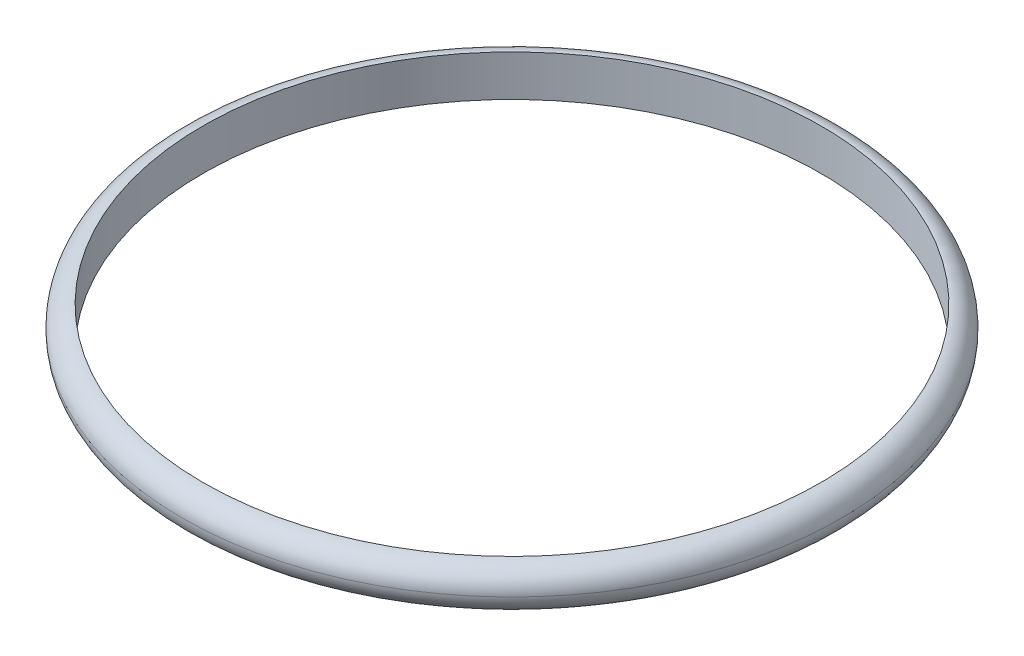
ISO-10303-21;
HEADER;
FILE_DESCRIPTION(('STEP AP214'),'2;1');
FILE_NAME('part.step','',(''),(''),'','','');
FILE_SCHEMA(('AUTOMOTIVE_DESIGN { 1 0 10303 214 1 1 1 1 }'));
ENDSEC;
DATA;
#1=APPLICATION_CONTEXT('core data for automotive mechanical design processes');
#2=APPLICATION_PROTOCOL_DEFINITION('international standard','automotive_design',2000,#1);
#3=PRODUCT_CONTEXT('',#1,'mechanical');
#4=PRODUCT('Part','Part','',(#3));
#5=PRODUCT_RELATED_PRODUCT_CATEGORY('part','',(#4));
#6=PRODUCT_DEFINITION_FORMATION('','',#4);
#7=PRODUCT_DEFINITION_CONTEXT('part definition',#1,'design');
#8=PRODUCT_DEFINITION('design','',#6,#7);
#9=PRODUCT_DEFINITION_SHAPE('','',#8);
#10=(LENGTH_UNIT() NAMED_UNIT(*) SI_UNIT(.MILLI.,.METRE.));
#11=(NAMED_UNIT(*) PLANE_ANGLE_UNIT() SI_UNIT($,.RADIAN.));
#12=(NAMED_UNIT(*) SI_UNIT($,.STERADIAN.) SOLID_ANGLE_UNIT());
#13=UNCERTAINTY_MEASURE_WITH_UNIT(LENGTH_MEASURE(1.E-05),#10,'distance_accuracy_value','');
#14=(GEOMETRIC_REPRESENTATION_CONTEXT(3) GLOBAL_UNCERTAINTY_ASSIGNED_CONTEXT((#13)) GLOBAL_UNIT_ASSIGNED_CONTEXT((#10,
#11,#12)) REPRESENTATION_CONTEXT('',''));
#15=CARTESIAN_POINT('',(0.,0.,0.));
#16=DIRECTION('',(0.,0.,1.));
#17=DIRECTION('',(1.,0.,0.));
#18=AXIS2_PLACEMENT_3D('',#15,#16,#17);
#19=CARTESIAN_POINT('',(0.,4.,0.));
#20=DIRECTION('',(0.,-1.,0.));
#21=DIRECTION('',(0.,0.,-1.));
#22=AXIS2_PLACEMENT_3D('',#19,#20,#21);
#23=CYLINDRICAL_SURFACE('',#22,30.);
#24=CARTESIAN_POINT('',(0.,4.,0.));
#25=DIRECTION('',(0.,1.,0.));
#26=DIRECTION('',(0.,0.,1.));
#27=AXIS2_PLACEMENT_3D('',#24,#25,#26);
#28=CIRCLE('',#27,30.);
#29=CARTESIAN_POINT('',(0.,4.,30.));
#30=VERTEX_POINT('',#29);
#31=EDGE_CURVE('E10',#30,#30,#28,.T.);
#32=ORIENTED_EDGE('',*,*,#31,.T.);
#33=EDGE_LOOP('',(#32));
#34=FACE_BOUND('',#33,.T.);
#35=CARTESIAN_POINT('',(0.,0.,0.));
#36=DIRECTION('',(0.,1.,0.));
#37=DIRECTION('',(0.,0.,1.));
#38=AXIS2_PLACEMENT_3D('',#35,#36,#37);
#39=CIRCLE('',#38,30.);
#40=CARTESIAN_POINT('',(0.,0.,30.));
#41=VERTEX_POINT('',#40);
#42=EDGE_CURVE('E39',#41,#41,#39,.T.);
#43=ORIENTED_EDGE('',*,*,#42,.F.);
#44=EDGE_LOOP('',(#43));
#45=FACE_BOUND('',#44,.T.);
#46=ADVANCED_FACE('F31',(#34,#45),#23,.F.);
#47=CARTESIAN_POINT('',(0.,2.,0.));
#48=DIRECTION('',(0.,1.,0.));
#49=DIRECTION('',(0.,0.,1.));
#50=AXIS2_PLACEMENT_3D('',#47,#48,#49);
#51=TOROIDAL_SURFACE('',#50,30.,2.);
#52=ORIENTED_EDGE('',*,*,#31,.F.);
#53=EDGE_LOOP('',(#52));
#54=FACE_BOUND('',#53,.T.);
#55=CARTESIAN_POINT('',(0.,2.,0.));
#56=DIRECTION('',(0.,1.,0.));
#57=DIRECTION('',(0.,0.,1.));
#58=AXIS2_PLACEMENT_3D('',#55,#56,#57);
#59=CIRCLE('',#58,32.);
#60=CARTESIAN_POINT('',(0.,2.,32.));
#61=VERTEX_POINT('',#60);
#62=EDGE_CURVE('E35',#61,#61,#59,.F.);
#63=ORIENTED_EDGE('',*,*,#62,.F.);
#64=EDGE_LOOP('',(#63));
#65=FACE_BOUND('',#64,.T.);
#66=ADVANCED_FACE('F33',(#54,#65),#51,.T.);
#67=CARTESIAN_POINT('',(0.,2.,0.));
#68=DIRECTION('',(0.,1.,0.));
#69=DIRECTION('',(0.,0.,1.));
#70=AXIS2_PLACEMENT_3D('',#67,#68,#69);
#71=TOROIDAL_SURFACE('',#70,30.,2.);
#72=ORIENTED_EDGE('',*,*,#42,.T.);
#73=EDGE_LOOP('',(#72));
#74=FACE_BOUND('',#73,.T.);
#75=ORIENTED_EDGE('',*,*,#62,.T.);
#76=EDGE_LOOP('',(#75));
#77=FACE_BOUND('',#76,.T.);
#78=ADVANCED_FACE('F49',(#74,#77),#71,.T.);
#79=CLOSED_SHELL('',(#46,#66,#78));
#80=MANIFOLD_SOLID_BREP('B2',#79);
#81=ADVANCED_BREP_SHAPE_REPRESENTATION('',(#18,#80),#14);
#82=SHAPE_DEFINITION_REPRESENTATION(#9,#81);
ENDSEC;
END-ISO-10303-21;
